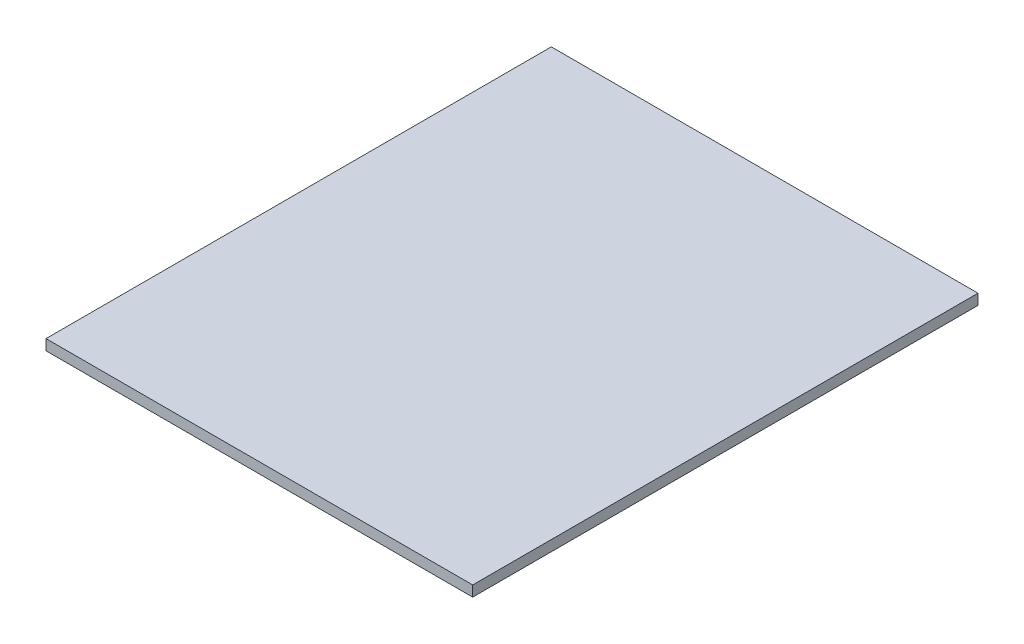
ISO-10303-21;
HEADER;
FILE_DESCRIPTION(('STEP AP214'),'2;1');
FILE_NAME('part.step','',(''),(''),'','','');
FILE_SCHEMA(('AUTOMOTIVE_DESIGN { 1 0 10303 214 1 1 1 1 }'));
ENDSEC;
DATA;
#1=APPLICATION_CONTEXT('core data for automotive mechanical design processes');
#2=APPLICATION_PROTOCOL_DEFINITION('international standard','automotive_design',2000,#1);
#3=PRODUCT_CONTEXT('',#1,'mechanical');
#4=PRODUCT('Part','Part','',(#3));
#5=PRODUCT_RELATED_PRODUCT_CATEGORY('part','',(#4));
#6=PRODUCT_DEFINITION_FORMATION('','',#4);
#7=PRODUCT_DEFINITION_CONTEXT('part definition',#1,'design');
#8=PRODUCT_DEFINITION('design','',#6,#7);
#9=PRODUCT_DEFINITION_SHAPE('','',#8);
#10=(LENGTH_UNIT() NAMED_UNIT(*) SI_UNIT(.MILLI.,.METRE.));
#11=(NAMED_UNIT(*) PLANE_ANGLE_UNIT() SI_UNIT($,.RADIAN.));
#12=(NAMED_UNIT(*) SI_UNIT($,.STERADIAN.) SOLID_ANGLE_UNIT());
#13=UNCERTAINTY_MEASURE_WITH_UNIT(LENGTH_MEASURE(1.E-05),#10,'distance_accuracy_value','');
#14=(GEOMETRIC_REPRESENTATION_CONTEXT(3) GLOBAL_UNCERTAINTY_ASSIGNED_CONTEXT((#13)) GLOBAL_UNIT_ASSIGNED_CONTEXT((#10,
#11,#12)) REPRESENTATION_CONTEXT('',''));
#15=CARTESIAN_POINT('',(0.,0.,0.));
#16=DIRECTION('',(0.,0.,1.));
#17=DIRECTION('',(1.,0.,0.));
#18=AXIS2_PLACEMENT_3D('',#15,#16,#17);
#19=CARTESIAN_POINT('',(60.452,1.4986,71.5899));
#20=DIRECTION('',(-1.,0.,0.));
#21=DIRECTION('',(0.,0.,1.));
#22=AXIS2_PLACEMENT_3D('',#19,#20,#21);
#23=PLANE('',#22);
#24=DIRECTION('',(0.,0.,-1.));
#25=VECTOR('',#24,1.);
#26=CARTESIAN_POINT('',(60.452,-1.4986,71.5899));
#27=LINE('',#26,#25);
#28=CARTESIAN_POINT('',(60.452,-1.4986,71.5899));
#29=VERTEX_POINT('',#28);
#30=CARTESIAN_POINT('',(60.452,-1.4986,-71.5899));
#31=VERTEX_POINT('',#30);
#32=EDGE_CURVE('E94',#29,#31,#27,.T.);
#33=ORIENTED_EDGE('',*,*,#32,.T.);
#34=DIRECTION('',(0.,-1.,0.));
#35=VECTOR('',#34,1.);
#36=CARTESIAN_POINT('',(60.452,1.4986,-71.5899));
#37=LINE('',#36,#35);
#38=CARTESIAN_POINT('',(60.452,1.4986,-71.5899));
#39=VERTEX_POINT('',#38);
#40=EDGE_CURVE('E11',#39,#31,#37,.T.);
#41=ORIENTED_EDGE('',*,*,#40,.F.);
#42=DIRECTION('',(0.,0.,-1.));
#43=VECTOR('',#42,1.);
#44=CARTESIAN_POINT('',(60.452,1.4986,71.5899));
#45=LINE('',#44,#43);
#46=CARTESIAN_POINT('',(60.452,1.4986,71.5899));
#47=VERTEX_POINT('',#46);
#48=EDGE_CURVE('E82',#47,#39,#45,.T.);
#49=ORIENTED_EDGE('',*,*,#48,.F.);
#50=DIRECTION('',(0.,-1.,0.));
#51=VECTOR('',#50,1.);
#52=CARTESIAN_POINT('',(60.452,1.4986,71.5899));
#53=LINE('',#52,#51);
#54=EDGE_CURVE('E90',#47,#29,#53,.T.);
#55=ORIENTED_EDGE('',*,*,#54,.T.);
#56=EDGE_LOOP('',(#33,#41,#49,#55));
#57=FACE_BOUND('',#56,.T.);
#58=ADVANCED_FACE('F31',(#57),#23,.F.);
#59=CARTESIAN_POINT('',(-60.452,1.4986,-71.5899));
#60=DIRECTION('',(0.,0.,1.));
#61=DIRECTION('',(1.,0.,0.));
#62=AXIS2_PLACEMENT_3D('',#59,#60,#61);
#63=PLANE('',#62);
#64=DIRECTION('',(-1.,0.,0.));
#65=VECTOR('',#64,1.);
#66=CARTESIAN_POINT('',(-60.452,-1.4986,-71.5899));
#67=LINE('',#66,#65);
#68=CARTESIAN_POINT('',(-60.452,-1.4986,-71.5899));
#69=VERTEX_POINT('',#68);
#70=EDGE_CURVE('E86',#31,#69,#67,.T.);
#71=ORIENTED_EDGE('',*,*,#70,.T.);
#72=DIRECTION('',(0.,-1.,0.));
#73=VECTOR('',#72,1.);
#74=CARTESIAN_POINT('',(-60.452,1.4986,-71.5899));
#75=LINE('',#74,#73);
#76=CARTESIAN_POINT('',(-60.452,1.4986,-71.5899));
#77=VERTEX_POINT('',#76);
#78=EDGE_CURVE('E39',#77,#69,#75,.T.);
#79=ORIENTED_EDGE('',*,*,#78,.F.);
#80=DIRECTION('',(-1.,0.,0.));
#81=VECTOR('',#80,1.);
#82=CARTESIAN_POINT('',(-60.452,1.4986,-71.5899));
#83=LINE('',#82,#81);
#84=EDGE_CURVE('E77',#39,#77,#83,.T.);
#85=ORIENTED_EDGE('',*,*,#84,.F.);
#86=ORIENTED_EDGE('',*,*,#40,.T.);
#87=EDGE_LOOP('',(#71,#79,#85,#86));
#88=FACE_BOUND('',#87,.T.);
#89=ADVANCED_FACE('F85',(#88),#63,.F.);
#90=CARTESIAN_POINT('',(-60.452,1.4986,71.5899));
#91=DIRECTION('',(1.,0.,0.));
#92=DIRECTION('',(0.,0.,-1.));
#93=AXIS2_PLACEMENT_3D('',#90,#91,#92);
#94=PLANE('',#93);
#95=DIRECTION('',(0.,0.,1.));
#96=VECTOR('',#95,1.);
#97=CARTESIAN_POINT('',(-60.452,-1.4986,71.5899));
#98=LINE('',#97,#96);
#99=CARTESIAN_POINT('',(-60.452,-1.4986,71.5899));
#100=VERTEX_POINT('',#99);
#101=EDGE_CURVE('E64',#69,#100,#98,.T.);
#102=ORIENTED_EDGE('',*,*,#101,.T.);
#103=DIRECTION('',(0.,-1.,0.));
#104=VECTOR('',#103,1.);
#105=CARTESIAN_POINT('',(-60.452,1.4986,71.5899));
#106=LINE('',#105,#104);
#107=CARTESIAN_POINT('',(-60.452,1.4986,71.5899));
#108=VERTEX_POINT('',#107);
#109=EDGE_CURVE('E87',#108,#100,#106,.T.);
#110=ORIENTED_EDGE('',*,*,#109,.F.);
#111=DIRECTION('',(0.,0.,1.));
#112=VECTOR('',#111,1.);
#113=CARTESIAN_POINT('',(-60.452,1.4986,71.5899));
#114=LINE('',#113,#112);
#115=EDGE_CURVE('E80',#77,#108,#114,.T.);
#116=ORIENTED_EDGE('',*,*,#115,.F.);
#117=ORIENTED_EDGE('',*,*,#78,.T.);
#118=EDGE_LOOP('',(#102,#110,#116,#117));
#119=FACE_BOUND('',#118,.T.);
#120=ADVANCED_FACE('F88',(#119),#94,.F.);
#121=CARTESIAN_POINT('',(-60.452,1.4986,71.5899));
#122=DIRECTION('',(0.,0.,-1.));
#123=DIRECTION('',(-1.,0.,0.));
#124=AXIS2_PLACEMENT_3D('',#121,#122,#123);
#125=PLANE('',#124);
#126=DIRECTION('',(1.,0.,0.));
#127=VECTOR('',#126,1.);
#128=CARTESIAN_POINT('',(-60.452,-1.4986,71.5899));
#129=LINE('',#128,#127);
#130=EDGE_CURVE('E70',#100,#29,#129,.T.);
#131=ORIENTED_EDGE('',*,*,#130,.T.);
#132=ORIENTED_EDGE('',*,*,#54,.F.);
#133=DIRECTION('',(1.,0.,0.));
#134=VECTOR('',#133,1.);
#135=CARTESIAN_POINT('',(-60.452,1.4986,71.5899));
#136=LINE('',#135,#134);
#137=EDGE_CURVE('E47',#108,#47,#136,.T.);
#138=ORIENTED_EDGE('',*,*,#137,.F.);
#139=ORIENTED_EDGE('',*,*,#109,.T.);
#140=EDGE_LOOP('',(#131,#132,#138,#139));
#141=FACE_BOUND('',#140,.T.);
#142=ADVANCED_FACE('F101',(#141),#125,.F.);
#143=CARTESIAN_POINT('',(60.452,1.4986,-71.5899));
#144=DIRECTION('',(0.,-1.,0.));
#145=DIRECTION('',(0.,0.,-1.));
#146=AXIS2_PLACEMENT_3D('',#143,#144,#145);
#147=PLANE('',#146);
#148=ORIENTED_EDGE('',*,*,#48,.T.);
#149=ORIENTED_EDGE('',*,*,#84,.T.);
#150=ORIENTED_EDGE('',*,*,#115,.T.);
#151=ORIENTED_EDGE('',*,*,#137,.T.);
#152=EDGE_LOOP('',(#148,#149,#150,#151));
#153=FACE_BOUND('',#152,.T.);
#154=ADVANCED_FACE('F78',(#153),#147,.F.);
#155=CARTESIAN_POINT('',(60.452,-1.4986,-71.5899));
#156=DIRECTION('',(0.,-1.,0.));
#157=DIRECTION('',(0.,0.,-1.));
#158=AXIS2_PLACEMENT_3D('',#155,#156,#157);
#159=PLANE('',#158);
#160=ORIENTED_EDGE('',*,*,#32,.F.);
#161=ORIENTED_EDGE('',*,*,#130,.F.);
#162=ORIENTED_EDGE('',*,*,#101,.F.);
#163=ORIENTED_EDGE('',*,*,#70,.F.);
#164=EDGE_LOOP('',(#160,#161,#162,#163));
#165=FACE_BOUND('',#164,.T.);
#166=ADVANCED_FACE('F104',(#165),#159,.T.);
#167=CLOSED_SHELL('',(#58,#89,#120,#142,#154,#166));
#168=MANIFOLD_SOLID_BREP('B2',#167);
#169=ADVANCED_BREP_SHAPE_REPRESENTATION('',(#18,#168),#14);
#170=SHAPE_DEFINITION_REPRESENTATION(#9,#169);
ENDSEC;
END-ISO-10303-21;
